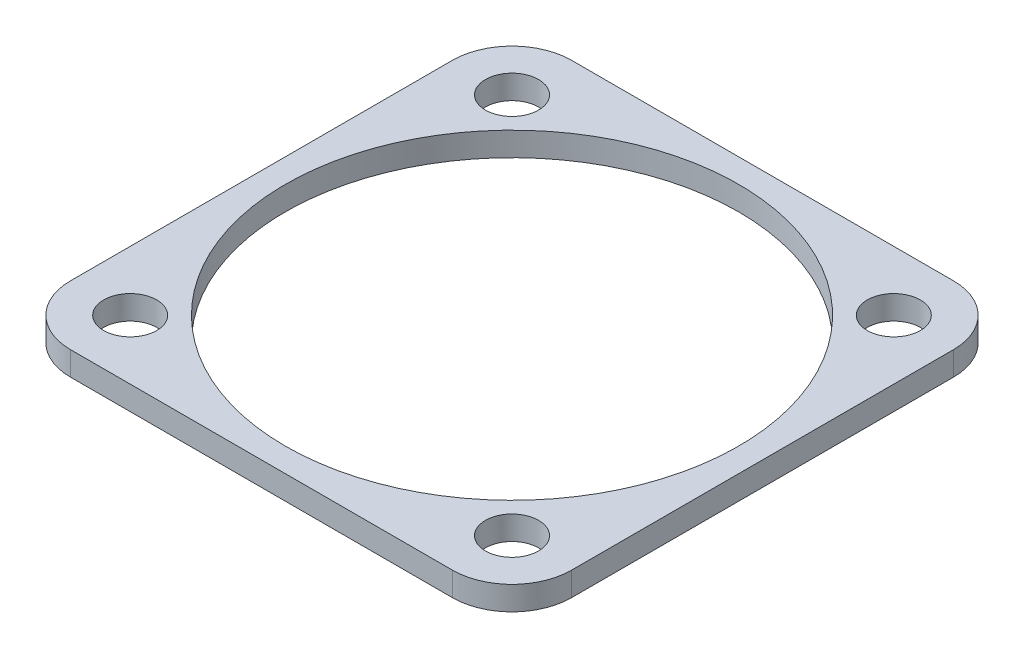
ISO-10303-21;
HEADER;
FILE_DESCRIPTION(('STEP AP214'),'2;1');
FILE_NAME('part.step','',(''),(''),'','','');
FILE_SCHEMA(('AUTOMOTIVE_DESIGN { 1 0 10303 214 1 1 1 1 }'));
ENDSEC;
DATA;
#1=APPLICATION_CONTEXT('core data for automotive mechanical design processes');
#2=APPLICATION_PROTOCOL_DEFINITION('international standard','automotive_design',2000,#1);
#3=PRODUCT_CONTEXT('',#1,'mechanical');
#4=PRODUCT('Part','Part','',(#3));
#5=PRODUCT_RELATED_PRODUCT_CATEGORY('part','',(#4));
#6=PRODUCT_DEFINITION_FORMATION('','',#4);
#7=PRODUCT_DEFINITION_CONTEXT('part definition',#1,'design');
#8=PRODUCT_DEFINITION('design','',#6,#7);
#9=PRODUCT_DEFINITION_SHAPE('','',#8);
#10=(LENGTH_UNIT() NAMED_UNIT(*) SI_UNIT(.MILLI.,.METRE.));
#11=(NAMED_UNIT(*) PLANE_ANGLE_UNIT() SI_UNIT($,.RADIAN.));
#12=(NAMED_UNIT(*) SI_UNIT($,.STERADIAN.) SOLID_ANGLE_UNIT());
#13=UNCERTAINTY_MEASURE_WITH_UNIT(LENGTH_MEASURE(1.E-05),#10,'distance_accuracy_value','');
#14=(GEOMETRIC_REPRESENTATION_CONTEXT(3) GLOBAL_UNCERTAINTY_ASSIGNED_CONTEXT((#13)) GLOBAL_UNIT_ASSIGNED_CONTEXT((#10,
#11,#12)) REPRESENTATION_CONTEXT('',''));
#15=CARTESIAN_POINT('',(0.,0.,0.));
#16=DIRECTION('',(0.,0.,1.));
#17=DIRECTION('',(1.,0.,0.));
#18=AXIS2_PLACEMENT_3D('',#15,#16,#17);
#19=CARTESIAN_POINT('',(-21.,2.,21.));
#20=DIRECTION('',(0.,0.,-1.));
#21=DIRECTION('',(-1.,0.,0.));
#22=AXIS2_PLACEMENT_3D('',#19,#20,#21);
#23=PLANE('',#22);
#24=DIRECTION('',(1.,0.,0.));
#25=VECTOR('',#24,1.);
#26=CARTESIAN_POINT('',(-21.,2.,21.));
#27=LINE('',#26,#25);
#28=CARTESIAN_POINT('',(-16.,2.,21.));
#29=VERTEX_POINT('',#28);
#30=CARTESIAN_POINT('',(16.,2.,21.));
#31=VERTEX_POINT('',#30);
#32=EDGE_CURVE('E155',#29,#31,#27,.T.);
#33=ORIENTED_EDGE('',*,*,#32,.F.);
#34=DIRECTION('',(0.,-1.,0.));
#35=VECTOR('',#34,1.);
#36=CARTESIAN_POINT('',(-16.,2.,21.));
#37=LINE('',#36,#35);
#38=CARTESIAN_POINT('',(-16.,0.,21.));
#39=VERTEX_POINT('',#38);
#40=EDGE_CURVE('E11',#29,#39,#37,.T.);
#41=ORIENTED_EDGE('',*,*,#40,.T.);
#42=DIRECTION('',(1.,0.,0.));
#43=VECTOR('',#42,1.);
#44=CARTESIAN_POINT('',(-21.,0.,21.));
#45=LINE('',#44,#43);
#46=CARTESIAN_POINT('',(16.,0.,21.));
#47=VERTEX_POINT('',#46);
#48=EDGE_CURVE('E158',#39,#47,#45,.T.);
#49=ORIENTED_EDGE('',*,*,#48,.T.);
#50=DIRECTION('',(0.,-1.,0.));
#51=VECTOR('',#50,1.);
#52=CARTESIAN_POINT('',(16.,2.,21.));
#53=LINE('',#52,#51);
#54=EDGE_CURVE('E44',#47,#31,#53,.F.);
#55=ORIENTED_EDGE('',*,*,#54,.T.);
#56=EDGE_LOOP('',(#33,#41,#49,#55));
#57=FACE_BOUND('',#56,.T.);
#58=ADVANCED_FACE('F36',(#57),#23,.F.);
#59=CARTESIAN_POINT('',(21.,2.,-21.));
#60=DIRECTION('',(1.,0.,0.));
#61=DIRECTION('',(0.,0.,-1.));
#62=AXIS2_PLACEMENT_3D('',#59,#60,#61);
#63=PLANE('',#62);
#64=DIRECTION('',(0.,0.,1.));
#65=VECTOR('',#64,1.);
#66=CARTESIAN_POINT('',(21.,0.,-21.));
#67=LINE('',#66,#65);
#68=CARTESIAN_POINT('',(21.,0.,-16.));
#69=VERTEX_POINT('',#68);
#70=CARTESIAN_POINT('',(21.,0.,16.));
#71=VERTEX_POINT('',#70);
#72=EDGE_CURVE('E122',#69,#71,#67,.T.);
#73=ORIENTED_EDGE('',*,*,#72,.F.);
#74=DIRECTION('',(0.,-1.,0.));
#75=VECTOR('',#74,1.);
#76=CARTESIAN_POINT('',(21.,2.,-16.));
#77=LINE('',#76,#75);
#78=CARTESIAN_POINT('',(21.,2.,-16.));
#79=VERTEX_POINT('',#78);
#80=EDGE_CURVE('E139',#69,#79,#77,.F.);
#81=ORIENTED_EDGE('',*,*,#80,.T.);
#82=DIRECTION('',(0.,0.,1.));
#83=VECTOR('',#82,1.);
#84=CARTESIAN_POINT('',(21.,2.,-21.));
#85=LINE('',#84,#83);
#86=CARTESIAN_POINT('',(21.,2.,16.));
#87=VERTEX_POINT('',#86);
#88=EDGE_CURVE('E165',#79,#87,#85,.T.);
#89=ORIENTED_EDGE('',*,*,#88,.T.);
#90=DIRECTION('',(0.,-1.,0.));
#91=VECTOR('',#90,1.);
#92=CARTESIAN_POINT('',(21.,0.,16.));
#93=LINE('',#92,#91);
#94=EDGE_CURVE('E136',#87,#71,#93,.T.);
#95=ORIENTED_EDGE('',*,*,#94,.T.);
#96=EDGE_LOOP('',(#73,#81,#89,#95));
#97=FACE_BOUND('',#96,.T.);
#98=ADVANCED_FACE('F171',(#97),#63,.T.);
#99=CARTESIAN_POINT('',(-21.,2.,-21.));
#100=DIRECTION('',(0.,0.,-1.));
#101=DIRECTION('',(-1.,0.,0.));
#102=AXIS2_PLACEMENT_3D('',#99,#100,#101);
#103=PLANE('',#102);
#104=DIRECTION('',(1.,0.,0.));
#105=VECTOR('',#104,1.);
#106=CARTESIAN_POINT('',(-21.,2.,-21.));
#107=LINE('',#106,#105);
#108=CARTESIAN_POINT('',(-16.,2.,-21.));
#109=VERTEX_POINT('',#108);
#110=CARTESIAN_POINT('',(16.,2.,-21.));
#111=VERTEX_POINT('',#110);
#112=EDGE_CURVE('E129',#109,#111,#107,.T.);
#113=ORIENTED_EDGE('',*,*,#112,.T.);
#114=DIRECTION('',(0.,-1.,0.));
#115=VECTOR('',#114,1.);
#116=CARTESIAN_POINT('',(16.,2.,-21.));
#117=LINE('',#116,#115);
#118=CARTESIAN_POINT('',(16.,0.,-21.));
#119=VERTEX_POINT('',#118);
#120=EDGE_CURVE('E121',#111,#119,#117,.T.);
#121=ORIENTED_EDGE('',*,*,#120,.T.);
#122=DIRECTION('',(1.,0.,0.));
#123=VECTOR('',#122,1.);
#124=CARTESIAN_POINT('',(-21.,0.,-21.));
#125=LINE('',#124,#123);
#126=CARTESIAN_POINT('',(-16.,0.,-21.));
#127=VERTEX_POINT('',#126);
#128=EDGE_CURVE('E106',#127,#119,#125,.T.);
#129=ORIENTED_EDGE('',*,*,#128,.F.);
#130=DIRECTION('',(0.,-1.,0.));
#131=VECTOR('',#130,1.);
#132=CARTESIAN_POINT('',(-16.,2.,-21.));
#133=LINE('',#132,#131);
#134=EDGE_CURVE('E119',#127,#109,#133,.F.);
#135=ORIENTED_EDGE('',*,*,#134,.T.);
#136=EDGE_LOOP('',(#113,#121,#129,#135));
#137=FACE_BOUND('',#136,.T.);
#138=ADVANCED_FACE('F118',(#137),#103,.T.);
#139=CARTESIAN_POINT('',(-21.,2.,-21.));
#140=DIRECTION('',(1.,0.,0.));
#141=DIRECTION('',(0.,0.,-1.));
#142=AXIS2_PLACEMENT_3D('',#139,#140,#141);
#143=PLANE('',#142);
#144=DIRECTION('',(0.,0.,1.));
#145=VECTOR('',#144,1.);
#146=CARTESIAN_POINT('',(-21.,2.,-21.));
#147=LINE('',#146,#145);
#148=CARTESIAN_POINT('',(-21.,2.,-16.));
#149=VERTEX_POINT('',#148);
#150=CARTESIAN_POINT('',(-21.,2.,16.));
#151=VERTEX_POINT('',#150);
#152=EDGE_CURVE('E125',#149,#151,#147,.T.);
#153=ORIENTED_EDGE('',*,*,#152,.F.);
#154=DIRECTION('',(0.,-1.,0.));
#155=VECTOR('',#154,1.);
#156=CARTESIAN_POINT('',(-21.,0.,-16.));
#157=LINE('',#156,#155);
#158=CARTESIAN_POINT('',(-21.,0.,-16.));
#159=VERTEX_POINT('',#158);
#160=EDGE_CURVE('E149',#149,#159,#157,.T.);
#161=ORIENTED_EDGE('',*,*,#160,.T.);
#162=DIRECTION('',(0.,0.,1.));
#163=VECTOR('',#162,1.);
#164=CARTESIAN_POINT('',(-21.,0.,-21.));
#165=LINE('',#164,#163);
#166=CARTESIAN_POINT('',(-21.,0.,16.));
#167=VERTEX_POINT('',#166);
#168=EDGE_CURVE('E107',#159,#167,#165,.T.);
#169=ORIENTED_EDGE('',*,*,#168,.T.);
#170=DIRECTION('',(0.,-1.,0.));
#171=VECTOR('',#170,1.);
#172=CARTESIAN_POINT('',(-21.,2.,16.));
#173=LINE('',#172,#171);
#174=EDGE_CURVE('E51',#167,#151,#173,.F.);
#175=ORIENTED_EDGE('',*,*,#174,.T.);
#176=EDGE_LOOP('',(#153,#161,#169,#175));
#177=FACE_BOUND('',#176,.T.);
#178=ADVANCED_FACE('F214',(#177),#143,.F.);
#179=CARTESIAN_POINT('',(0.,2.,0.));
#180=DIRECTION('',(0.,-1.,0.));
#181=DIRECTION('',(0.,0.,-1.));
#182=AXIS2_PLACEMENT_3D('',#179,#180,#181);
#183=PLANE('',#182);
#184=CARTESIAN_POINT('',(-16.,2.,-16.));
#185=DIRECTION('',(0.,1.,0.));
#186=DIRECTION('',(0.,0.,1.));
#187=AXIS2_PLACEMENT_3D('',#184,#185,#186);
#188=CIRCLE('',#187,2.225);
#189=CARTESIAN_POINT('',(-16.,2.,-13.775));
#190=VERTEX_POINT('',#189);
#191=EDGE_CURVE('E188',#190,#190,#188,.T.);
#192=ORIENTED_EDGE('',*,*,#191,.F.);
#193=EDGE_LOOP('',(#192));
#194=FACE_BOUND('',#193,.T.);
#195=CARTESIAN_POINT('',(16.,2.,-16.));
#196=DIRECTION('',(0.,1.,0.));
#197=DIRECTION('',(0.,0.,1.));
#198=AXIS2_PLACEMENT_3D('',#195,#196,#197);
#199=CIRCLE('',#198,2.225);
#200=CARTESIAN_POINT('',(16.,2.,-13.775));
#201=VERTEX_POINT('',#200);
#202=EDGE_CURVE('E189',#201,#201,#199,.T.);
#203=ORIENTED_EDGE('',*,*,#202,.F.);
#204=EDGE_LOOP('',(#203));
#205=FACE_BOUND('',#204,.T.);
#206=CARTESIAN_POINT('',(0.,2.,0.));
#207=DIRECTION('',(0.,1.,0.));
#208=DIRECTION('',(0.,0.,1.));
#209=AXIS2_PLACEMENT_3D('',#206,#207,#208);
#210=CIRCLE('',#209,19.);
#211=CARTESIAN_POINT('',(0.,2.,19.));
#212=VERTEX_POINT('',#211);
#213=EDGE_CURVE('E205',#212,#212,#210,.T.);
#214=ORIENTED_EDGE('',*,*,#213,.F.);
#215=EDGE_LOOP('',(#214));
#216=FACE_BOUND('',#215,.T.);
#217=CARTESIAN_POINT('',(16.,2.,16.));
#218=DIRECTION('',(0.,1.,0.));
#219=DIRECTION('',(0.,0.,1.));
#220=AXIS2_PLACEMENT_3D('',#217,#218,#219);
#221=CIRCLE('',#220,2.225);
#222=CARTESIAN_POINT('',(16.,2.,18.225));
#223=VERTEX_POINT('',#222);
#224=EDGE_CURVE('E199',#223,#223,#221,.T.);
#225=ORIENTED_EDGE('',*,*,#224,.F.);
#226=EDGE_LOOP('',(#225));
#227=FACE_BOUND('',#226,.T.);
#228=CARTESIAN_POINT('',(-16.,2.,16.));
#229=DIRECTION('',(0.,1.,0.));
#230=DIRECTION('',(0.,0.,1.));
#231=AXIS2_PLACEMENT_3D('',#228,#229,#230);
#232=CIRCLE('',#231,2.225);
#233=CARTESIAN_POINT('',(-16.,2.,18.225));
#234=VERTEX_POINT('',#233);
#235=EDGE_CURVE('E181',#234,#234,#232,.T.);
#236=ORIENTED_EDGE('',*,*,#235,.F.);
#237=EDGE_LOOP('',(#236));
#238=FACE_BOUND('',#237,.T.);
#239=ORIENTED_EDGE('',*,*,#88,.F.);
#240=CARTESIAN_POINT('',(16.,2.,-16.));
#241=DIRECTION('',(0.,-1.,0.));
#242=DIRECTION('',(0.,0.,-1.));
#243=AXIS2_PLACEMENT_3D('',#240,#241,#242);
#244=CIRCLE('',#243,5.);
#245=EDGE_CURVE('E146',#79,#111,#244,.F.);
#246=ORIENTED_EDGE('',*,*,#245,.T.);
#247=ORIENTED_EDGE('',*,*,#112,.F.);
#248=CARTESIAN_POINT('',(-16.,2.,-16.));
#249=DIRECTION('',(0.,-1.,0.));
#250=DIRECTION('',(0.,0.,-1.));
#251=AXIS2_PLACEMENT_3D('',#248,#249,#250);
#252=CIRCLE('',#251,5.);
#253=EDGE_CURVE('E58',#109,#149,#252,.F.);
#254=ORIENTED_EDGE('',*,*,#253,.T.);
#255=ORIENTED_EDGE('',*,*,#152,.T.);
#256=CARTESIAN_POINT('',(-16.,2.,16.));
#257=DIRECTION('',(0.,-1.,0.));
#258=DIRECTION('',(0.,0.,-1.));
#259=AXIS2_PLACEMENT_3D('',#256,#257,#258);
#260=CIRCLE('',#259,5.);
#261=EDGE_CURVE('E143',#151,#29,#260,.F.);
#262=ORIENTED_EDGE('',*,*,#261,.T.);
#263=ORIENTED_EDGE('',*,*,#32,.T.);
#264=CARTESIAN_POINT('',(16.,2.,16.));
#265=DIRECTION('',(0.,-1.,0.));
#266=DIRECTION('',(0.,0.,-1.));
#267=AXIS2_PLACEMENT_3D('',#264,#265,#266);
#268=CIRCLE('',#267,5.);
#269=EDGE_CURVE('E141',#31,#87,#268,.F.);
#270=ORIENTED_EDGE('',*,*,#269,.T.);
#271=EDGE_LOOP('',(#239,#246,#247,#254,#255,#262,#263,#270));
#272=FACE_BOUND('',#271,.T.);
#273=ADVANCED_FACE('F162',(#194,#205,#216,#227,#238,#272),#183,.F.);
#274=CARTESIAN_POINT('',(0.,0.,0.));
#275=DIRECTION('',(0.,-1.,0.));
#276=DIRECTION('',(0.,0.,-1.));
#277=AXIS2_PLACEMENT_3D('',#274,#275,#276);
#278=PLANE('',#277);
#279=CARTESIAN_POINT('',(-16.,0.,-16.));
#280=DIRECTION('',(0.,-1.,0.));
#281=DIRECTION('',(0.,0.,-1.));
#282=AXIS2_PLACEMENT_3D('',#279,#280,#281);
#283=CIRCLE('',#282,2.225);
#284=CARTESIAN_POINT('',(-16.,0.,-18.225));
#285=VERTEX_POINT('',#284);
#286=EDGE_CURVE('E184',#285,#285,#283,.F.);
#287=ORIENTED_EDGE('',*,*,#286,.T.);
#288=EDGE_LOOP('',(#287));
#289=FACE_BOUND('',#288,.T.);
#290=CARTESIAN_POINT('',(16.,0.,-16.));
#291=DIRECTION('',(0.,-1.,0.));
#292=DIRECTION('',(0.,0.,-1.));
#293=AXIS2_PLACEMENT_3D('',#290,#291,#292);
#294=CIRCLE('',#293,2.225);
#295=CARTESIAN_POINT('',(16.,0.,-18.225));
#296=VERTEX_POINT('',#295);
#297=EDGE_CURVE('E185',#296,#296,#294,.F.);
#298=ORIENTED_EDGE('',*,*,#297,.T.);
#299=EDGE_LOOP('',(#298));
#300=FACE_BOUND('',#299,.T.);
#301=CARTESIAN_POINT('',(0.,0.,0.));
#302=DIRECTION('',(0.,-1.,0.));
#303=DIRECTION('',(0.,0.,-1.));
#304=AXIS2_PLACEMENT_3D('',#301,#302,#303);
#305=CIRCLE('',#304,19.);
#306=CARTESIAN_POINT('',(0.,0.,-19.));
#307=VERTEX_POINT('',#306);
#308=EDGE_CURVE('E202',#307,#307,#305,.F.);
#309=ORIENTED_EDGE('',*,*,#308,.T.);
#310=EDGE_LOOP('',(#309));
#311=FACE_BOUND('',#310,.T.);
#312=CARTESIAN_POINT('',(16.,0.,16.));
#313=DIRECTION('',(0.,-1.,0.));
#314=DIRECTION('',(0.,0.,-1.));
#315=AXIS2_PLACEMENT_3D('',#312,#313,#314);
#316=CIRCLE('',#315,2.225);
#317=CARTESIAN_POINT('',(16.,0.,13.775));
#318=VERTEX_POINT('',#317);
#319=EDGE_CURVE('E192',#318,#318,#316,.F.);
#320=ORIENTED_EDGE('',*,*,#319,.T.);
#321=EDGE_LOOP('',(#320));
#322=FACE_BOUND('',#321,.T.);
#323=CARTESIAN_POINT('',(-16.,0.,16.));
#324=DIRECTION('',(0.,-1.,0.));
#325=DIRECTION('',(0.,0.,-1.));
#326=AXIS2_PLACEMENT_3D('',#323,#324,#325);
#327=CIRCLE('',#326,2.225);
#328=CARTESIAN_POINT('',(-16.,0.,13.775));
#329=VERTEX_POINT('',#328);
#330=EDGE_CURVE('E174',#329,#329,#327,.F.);
#331=ORIENTED_EDGE('',*,*,#330,.T.);
#332=EDGE_LOOP('',(#331));
#333=FACE_BOUND('',#332,.T.);
#334=ORIENTED_EDGE('',*,*,#128,.T.);
#335=CARTESIAN_POINT('',(16.,0.,-16.));
#336=DIRECTION('',(0.,-1.,0.));
#337=DIRECTION('',(0.,0.,-1.));
#338=AXIS2_PLACEMENT_3D('',#335,#336,#337);
#339=CIRCLE('',#338,5.);
#340=EDGE_CURVE('E112',#119,#69,#339,.T.);
#341=ORIENTED_EDGE('',*,*,#340,.T.);
#342=ORIENTED_EDGE('',*,*,#72,.T.);
#343=CARTESIAN_POINT('',(16.,0.,16.));
#344=DIRECTION('',(0.,-1.,0.));
#345=DIRECTION('',(0.,0.,-1.));
#346=AXIS2_PLACEMENT_3D('',#343,#344,#345);
#347=CIRCLE('',#346,5.);
#348=EDGE_CURVE('E127',#71,#47,#347,.T.);
#349=ORIENTED_EDGE('',*,*,#348,.T.);
#350=ORIENTED_EDGE('',*,*,#48,.F.);
#351=CARTESIAN_POINT('',(-16.,0.,16.));
#352=DIRECTION('',(0.,-1.,0.));
#353=DIRECTION('',(0.,0.,-1.));
#354=AXIS2_PLACEMENT_3D('',#351,#352,#353);
#355=CIRCLE('',#354,5.);
#356=EDGE_CURVE('E113',#39,#167,#355,.T.);
#357=ORIENTED_EDGE('',*,*,#356,.T.);
#358=ORIENTED_EDGE('',*,*,#168,.F.);
#359=CARTESIAN_POINT('',(-16.,0.,-16.));
#360=DIRECTION('',(0.,-1.,0.));
#361=DIRECTION('',(0.,0.,-1.));
#362=AXIS2_PLACEMENT_3D('',#359,#360,#361);
#363=CIRCLE('',#362,5.);
#364=EDGE_CURVE('E103',#159,#127,#363,.T.);
#365=ORIENTED_EDGE('',*,*,#364,.T.);
#366=EDGE_LOOP('',(#334,#341,#342,#349,#350,#357,#358,#365));
#367=FACE_BOUND('',#366,.T.);
#368=ADVANCED_FACE('F105',(#289,#300,#311,#322,#333,#367),#278,.T.);
#369=CARTESIAN_POINT('',(-16.,-53.7401153701776,16.));
#370=DIRECTION('',(0.,1.,0.));
#371=DIRECTION('',(0.,0.,1.));
#372=AXIS2_PLACEMENT_3D('',#369,#370,#371);
#373=CYLINDRICAL_SURFACE('',#372,2.225);
#374=ORIENTED_EDGE('',*,*,#235,.T.);
#375=EDGE_LOOP('',(#374));
#376=FACE_BOUND('',#375,.T.);
#377=ORIENTED_EDGE('',*,*,#330,.F.);
#378=EDGE_LOOP('',(#377));
#379=FACE_BOUND('',#378,.T.);
#380=ADVANCED_FACE('F221',(#376,#379),#373,.F.);
#381=CARTESIAN_POINT('',(16.,-53.7401153701776,16.));
#382=DIRECTION('',(0.,1.,0.));
#383=DIRECTION('',(0.,0.,1.));
#384=AXIS2_PLACEMENT_3D('',#381,#382,#383);
#385=CYLINDRICAL_SURFACE('',#384,2.225);
#386=ORIENTED_EDGE('',*,*,#224,.T.);
#387=EDGE_LOOP('',(#386));
#388=FACE_BOUND('',#387,.T.);
#389=ORIENTED_EDGE('',*,*,#319,.F.);
#390=EDGE_LOOP('',(#389));
#391=FACE_BOUND('',#390,.T.);
#392=ADVANCED_FACE('F224',(#388,#391),#385,.F.);
#393=CARTESIAN_POINT('',(0.,-53.7401153701776,0.));
#394=DIRECTION('',(0.,1.,0.));
#395=DIRECTION('',(0.,0.,1.));
#396=AXIS2_PLACEMENT_3D('',#393,#394,#395);
#397=CYLINDRICAL_SURFACE('',#396,19.);
#398=ORIENTED_EDGE('',*,*,#213,.T.);
#399=EDGE_LOOP('',(#398));
#400=FACE_BOUND('',#399,.T.);
#401=ORIENTED_EDGE('',*,*,#308,.F.);
#402=EDGE_LOOP('',(#401));
#403=FACE_BOUND('',#402,.T.);
#404=ADVANCED_FACE('F209',(#400,#403),#397,.F.);
#405=CARTESIAN_POINT('',(16.,-53.7401153701776,-16.));
#406=DIRECTION('',(0.,1.,0.));
#407=DIRECTION('',(0.,0.,1.));
#408=AXIS2_PLACEMENT_3D('',#405,#406,#407);
#409=CYLINDRICAL_SURFACE('',#408,2.225);
#410=ORIENTED_EDGE('',*,*,#202,.T.);
#411=EDGE_LOOP('',(#410));
#412=FACE_BOUND('',#411,.T.);
#413=ORIENTED_EDGE('',*,*,#297,.F.);
#414=EDGE_LOOP('',(#413));
#415=FACE_BOUND('',#414,.T.);
#416=ADVANCED_FACE('F278',(#412,#415),#409,.F.);
#417=CARTESIAN_POINT('',(-16.,-53.7401153701776,-16.));
#418=DIRECTION('',(0.,1.,0.));
#419=DIRECTION('',(0.,0.,1.));
#420=AXIS2_PLACEMENT_3D('',#417,#418,#419);
#421=CYLINDRICAL_SURFACE('',#420,2.225);
#422=ORIENTED_EDGE('',*,*,#191,.T.);
#423=EDGE_LOOP('',(#422));
#424=FACE_BOUND('',#423,.T.);
#425=ORIENTED_EDGE('',*,*,#286,.F.);
#426=EDGE_LOOP('',(#425));
#427=FACE_BOUND('',#426,.T.);
#428=ADVANCED_FACE('F246',(#424,#427),#421,.F.);
#429=CARTESIAN_POINT('',(16.,2.,-16.));
#430=DIRECTION('',(0.,-1.,0.));
#431=DIRECTION('',(0.,0.,-1.));
#432=AXIS2_PLACEMENT_3D('',#429,#430,#431);
#433=CYLINDRICAL_SURFACE('',#432,5.);
#434=ORIENTED_EDGE('',*,*,#245,.F.);
#435=ORIENTED_EDGE('',*,*,#80,.F.);
#436=ORIENTED_EDGE('',*,*,#340,.F.);
#437=ORIENTED_EDGE('',*,*,#120,.F.);
#438=EDGE_LOOP('',(#434,#435,#436,#437));
#439=FACE_BOUND('',#438,.T.);
#440=ADVANCED_FACE('F243',(#439),#433,.T.);
#441=CARTESIAN_POINT('',(-16.,2.,-16.));
#442=DIRECTION('',(0.,1.,0.));
#443=DIRECTION('',(0.,0.,1.));
#444=AXIS2_PLACEMENT_3D('',#441,#442,#443);
#445=CYLINDRICAL_SURFACE('',#444,5.);
#446=ORIENTED_EDGE('',*,*,#253,.F.);
#447=ORIENTED_EDGE('',*,*,#134,.F.);
#448=ORIENTED_EDGE('',*,*,#364,.F.);
#449=ORIENTED_EDGE('',*,*,#160,.F.);
#450=EDGE_LOOP('',(#446,#447,#448,#449));
#451=FACE_BOUND('',#450,.T.);
#452=ADVANCED_FACE('F124',(#451),#445,.T.);
#453=CARTESIAN_POINT('',(-16.,2.,16.));
#454=DIRECTION('',(0.,-1.,0.));
#455=DIRECTION('',(0.,0.,-1.));
#456=AXIS2_PLACEMENT_3D('',#453,#454,#455);
#457=CYLINDRICAL_SURFACE('',#456,5.);
#458=ORIENTED_EDGE('',*,*,#261,.F.);
#459=ORIENTED_EDGE('',*,*,#174,.F.);
#460=ORIENTED_EDGE('',*,*,#356,.F.);
#461=ORIENTED_EDGE('',*,*,#40,.F.);
#462=EDGE_LOOP('',(#458,#459,#460,#461));
#463=FACE_BOUND('',#462,.T.);
#464=ADVANCED_FACE('F249',(#463),#457,.T.);
#465=CARTESIAN_POINT('',(16.,2.,16.));
#466=DIRECTION('',(0.,1.,0.));
#467=DIRECTION('',(0.,0.,1.));
#468=AXIS2_PLACEMENT_3D('',#465,#466,#467);
#469=CYLINDRICAL_SURFACE('',#468,5.);
#470=ORIENTED_EDGE('',*,*,#269,.F.);
#471=ORIENTED_EDGE('',*,*,#54,.F.);
#472=ORIENTED_EDGE('',*,*,#348,.F.);
#473=ORIENTED_EDGE('',*,*,#94,.F.);
#474=EDGE_LOOP('',(#470,#471,#472,#473));
#475=FACE_BOUND('',#474,.T.);
#476=ADVANCED_FACE('F38',(#475),#469,.T.);
#477=CLOSED_SHELL('',(#58,#98,#138,#178,#273,#368,#380,#392,#404,#416,#428,#440,#452,#464,#476));
#478=MANIFOLD_SOLID_BREP('B2',#477);
#479=ADVANCED_BREP_SHAPE_REPRESENTATION('',(#18,#478),#14);
#480=SHAPE_DEFINITION_REPRESENTATION(#9,#479);
ENDSEC;
END-ISO-10303-21;
